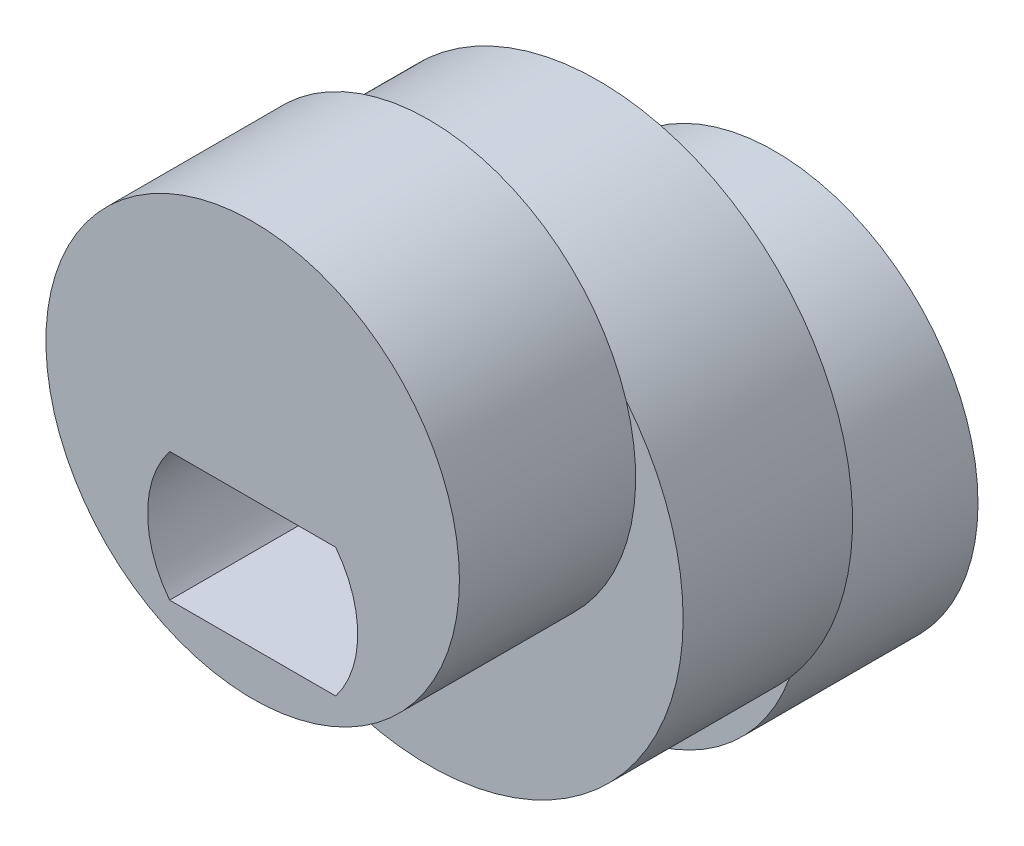
ISO-10303-21;
HEADER;
FILE_DESCRIPTION(('STEP AP214'),'2;1');
FILE_NAME('part.step','',(''),(''),'','','');
FILE_SCHEMA(('AUTOMOTIVE_DESIGN { 1 0 10303 214 1 1 1 1 }'));
ENDSEC;
DATA;
#1=APPLICATION_CONTEXT('core data for automotive mechanical design processes');
#2=APPLICATION_PROTOCOL_DEFINITION('international standard','automotive_design',2000,#1);
#3=PRODUCT_CONTEXT('',#1,'mechanical');
#4=PRODUCT('Part','Part','',(#3));
#5=PRODUCT_RELATED_PRODUCT_CATEGORY('part','',(#4));
#6=PRODUCT_DEFINITION_FORMATION('','',#4);
#7=PRODUCT_DEFINITION_CONTEXT('part definition',#1,'design');
#8=PRODUCT_DEFINITION('design','',#6,#7);
#9=PRODUCT_DEFINITION_SHAPE('','',#8);
#10=(LENGTH_UNIT() NAMED_UNIT(*) SI_UNIT(.MILLI.,.METRE.));
#11=(NAMED_UNIT(*) PLANE_ANGLE_UNIT() SI_UNIT($,.RADIAN.));
#12=(NAMED_UNIT(*) SI_UNIT($,.STERADIAN.) SOLID_ANGLE_UNIT());
#13=UNCERTAINTY_MEASURE_WITH_UNIT(LENGTH_MEASURE(1.E-05),#10,'distance_accuracy_value','');
#14=(GEOMETRIC_REPRESENTATION_CONTEXT(3) GLOBAL_UNCERTAINTY_ASSIGNED_CONTEXT((#13)) GLOBAL_UNIT_ASSIGNED_CONTEXT((#10,
#11,#12)) REPRESENTATION_CONTEXT('',''));
#15=CARTESIAN_POINT('',(0.,0.,0.));
#16=DIRECTION('',(0.,0.,1.));
#17=DIRECTION('',(1.,0.,0.));
#18=AXIS2_PLACEMENT_3D('',#15,#16,#17);
#19=CARTESIAN_POINT('',(0.,0.,2.5));
#20=DIRECTION('',(0.,0.,-1.));
#21=DIRECTION('',(-1.,0.,0.));
#22=AXIS2_PLACEMENT_3D('',#19,#20,#21);
#23=CYLINDRICAL_SURFACE('',#22,7.5);
#24=CARTESIAN_POINT('',(0.,0.,2.5));
#25=DIRECTION('',(0.,0.,1.));
#26=DIRECTION('',(1.,0.,0.));
#27=AXIS2_PLACEMENT_3D('',#24,#25,#26);
#28=CIRCLE('',#27,7.5);
#29=CARTESIAN_POINT('',(5.81816086390603,4.73275862068966,2.5));
#30=VERTEX_POINT('',#29);
#31=CARTESIAN_POINT('',(-5.81816086390603,4.73275862068966,2.5));
#32=VERTEX_POINT('',#31);
#33=EDGE_CURVE('E162',#30,#32,#28,.T.);
#34=ORIENTED_EDGE('',*,*,#33,.F.);
#35=EDGE_CURVE('E165',#32,#30,#28,.T.);
#36=ORIENTED_EDGE('',*,*,#35,.F.);
#37=EDGE_LOOP('',(#34,#36));
#38=FACE_BOUND('',#37,.T.);
#39=CARTESIAN_POINT('',(0.,0.,-2.5));
#40=DIRECTION('',(0.,0.,1.));
#41=DIRECTION('',(1.,0.,0.));
#42=AXIS2_PLACEMENT_3D('',#39,#40,#41);
#43=CIRCLE('',#42,7.5);
#44=CARTESIAN_POINT('',(-5.64205374941573,-4.94137931034483,-2.5));
#45=VERTEX_POINT('',#44);
#46=CARTESIAN_POINT('',(5.64205374941573,-4.94137931034483,-2.5));
#47=VERTEX_POINT('',#46);
#48=EDGE_CURVE('E48',#45,#47,#43,.T.);
#49=ORIENTED_EDGE('',*,*,#48,.T.);
#50=EDGE_CURVE('E159',#47,#45,#43,.T.);
#51=ORIENTED_EDGE('',*,*,#50,.T.);
#52=EDGE_LOOP('',(#49,#51));
#53=FACE_BOUND('',#52,.T.);
#54=ADVANCED_FACE('F45',(#38,#53),#23,.T.);
#55=CARTESIAN_POINT('',(0.,0.,2.5));
#56=DIRECTION('',(0.,0.,1.));
#57=DIRECTION('',(1.,0.,0.));
#58=AXIS2_PLACEMENT_3D('',#55,#56,#57);
#59=PLANE('',#58);
#60=CARTESIAN_POINT('',(0.,2.9,2.5));
#61=DIRECTION('',(0.,0.,1.));
#62=DIRECTION('',(1.,0.,0.));
#63=AXIS2_PLACEMENT_3D('',#60,#61,#62);
#64=CIRCLE('',#63,6.1);
#65=EDGE_CURVE('E54',#32,#30,#64,.T.);
#66=ORIENTED_EDGE('',*,*,#65,.F.);
#67=ORIENTED_EDGE('',*,*,#35,.T.);
#68=EDGE_LOOP('',(#66,#67));
#69=FACE_BOUND('',#68,.T.);
#70=ADVANCED_FACE('F189',(#69),#59,.T.);
#71=CARTESIAN_POINT('',(0.,0.,-2.5));
#72=DIRECTION('',(0.,0.,1.));
#73=DIRECTION('',(1.,0.,0.));
#74=AXIS2_PLACEMENT_3D('',#71,#72,#73);
#75=PLANE('',#74);
#76=CARTESIAN_POINT('',(0.,-2.9,-2.5));
#77=DIRECTION('',(0.,0.,-1.));
#78=DIRECTION('',(-1.,0.,0.));
#79=AXIS2_PLACEMENT_3D('',#76,#77,#78);
#80=CIRCLE('',#79,6.);
#81=EDGE_CURVE('E11',#45,#47,#80,.T.);
#82=ORIENTED_EDGE('',*,*,#81,.F.);
#83=ORIENTED_EDGE('',*,*,#50,.F.);
#84=EDGE_LOOP('',(#82,#83));
#85=FACE_BOUND('',#84,.T.);
#86=ADVANCED_FACE('F186',(#85),#75,.F.);
#87=CARTESIAN_POINT('',(0.,2.9,2.5));
#88=DIRECTION('',(0.,0.,1.));
#89=DIRECTION('',(1.,0.,0.));
#90=AXIS2_PLACEMENT_3D('',#87,#88,#89);
#91=PLANE('',#90);
#92=EDGE_CURVE('E151',#30,#32,#64,.T.);
#93=ORIENTED_EDGE('',*,*,#92,.F.);
#94=ORIENTED_EDGE('',*,*,#33,.T.);
#95=EDGE_LOOP('',(#93,#94));
#96=FACE_BOUND('',#95,.T.);
#97=ADVANCED_FACE('F188',(#96),#91,.F.);
#98=CARTESIAN_POINT('',(0.,2.9,7.7));
#99=DIRECTION('',(0.,0.,-1.));
#100=DIRECTION('',(-1.,0.,0.));
#101=AXIS2_PLACEMENT_3D('',#98,#99,#100);
#102=CYLINDRICAL_SURFACE('',#101,6.1);
#103=CARTESIAN_POINT('',(0.,2.9,7.7));
#104=DIRECTION('',(0.,0.,1.));
#105=DIRECTION('',(1.,0.,0.));
#106=AXIS2_PLACEMENT_3D('',#103,#104,#105);
#107=CIRCLE('',#106,6.1);
#108=CARTESIAN_POINT('',(6.1,2.9,7.7));
#109=VERTEX_POINT('',#108);
#110=EDGE_CURVE('E155',#109,#109,#107,.T.);
#111=ORIENTED_EDGE('',*,*,#110,.F.);
#112=EDGE_LOOP('',(#111));
#113=FACE_BOUND('',#112,.T.);
#114=ORIENTED_EDGE('',*,*,#92,.T.);
#115=ORIENTED_EDGE('',*,*,#65,.T.);
#116=EDGE_LOOP('',(#114,#115));
#117=FACE_BOUND('',#116,.T.);
#118=ADVANCED_FACE('F195',(#113,#117),#102,.T.);
#119=CARTESIAN_POINT('',(0.,2.9,7.7));
#120=DIRECTION('',(0.,0.,1.));
#121=DIRECTION('',(1.,0.,0.));
#122=AXIS2_PLACEMENT_3D('',#119,#120,#121);
#123=PLANE('',#122);
#124=CARTESIAN_POINT('',(0.,0.,7.7));
#125=DIRECTION('',(0.,0.,1.));
#126=DIRECTION('',(1.,0.,0.));
#127=AXIS2_PLACEMENT_3D('',#124,#125,#126);
#128=CIRCLE('',#127,3.1);
#129=CARTESIAN_POINT('',(-2.44948974278318,1.9,7.7));
#130=VERTEX_POINT('',#129);
#131=CARTESIAN_POINT('',(-2.44948974278318,-1.9,7.7));
#132=VERTEX_POINT('',#131);
#133=EDGE_CURVE('E63',#130,#132,#128,.T.);
#134=ORIENTED_EDGE('',*,*,#133,.F.);
#135=DIRECTION('',(-1.,0.,0.));
#136=VECTOR('',#135,1.);
#137=CARTESIAN_POINT('',(-2.44948974278318,1.9,7.7));
#138=LINE('',#137,#136);
#139=CARTESIAN_POINT('',(2.44948974278318,1.9,7.7));
#140=VERTEX_POINT('',#139);
#141=EDGE_CURVE('E121',#140,#130,#138,.T.);
#142=ORIENTED_EDGE('',*,*,#141,.F.);
#143=CARTESIAN_POINT('',(0.,0.,7.7));
#144=DIRECTION('',(0.,0.,1.));
#145=DIRECTION('',(1.,0.,0.));
#146=AXIS2_PLACEMENT_3D('',#143,#144,#145);
#147=CIRCLE('',#146,3.1);
#148=CARTESIAN_POINT('',(2.44948974278318,-1.9,7.7));
#149=VERTEX_POINT('',#148);
#150=EDGE_CURVE('E103',#149,#140,#147,.T.);
#151=ORIENTED_EDGE('',*,*,#150,.F.);
#152=DIRECTION('',(1.,0.,0.));
#153=VECTOR('',#152,1.);
#154=CARTESIAN_POINT('',(-2.44948974278318,-1.9,7.7));
#155=LINE('',#154,#153);
#156=EDGE_CURVE('E113',#132,#149,#155,.T.);
#157=ORIENTED_EDGE('',*,*,#156,.F.);
#158=EDGE_LOOP('',(#134,#142,#151,#157));
#159=FACE_BOUND('',#158,.T.);
#160=ORIENTED_EDGE('',*,*,#110,.T.);
#161=EDGE_LOOP('',(#160));
#162=FACE_BOUND('',#161,.T.);
#163=ADVANCED_FACE('F118',(#159,#162),#123,.T.);
#164=CARTESIAN_POINT('',(0.,-2.9,-7.7));
#165=DIRECTION('',(0.,0.,1.));
#166=DIRECTION('',(1.,0.,0.));
#167=AXIS2_PLACEMENT_3D('',#164,#165,#166);
#168=CYLINDRICAL_SURFACE('',#167,6.);
#169=CARTESIAN_POINT('',(0.,-2.9,-7.7));
#170=DIRECTION('',(0.,0.,-1.));
#171=DIRECTION('',(-1.,0.,0.));
#172=AXIS2_PLACEMENT_3D('',#169,#170,#171);
#173=CIRCLE('',#172,6.);
#174=CARTESIAN_POINT('',(-6.,-2.9,-7.7));
#175=VERTEX_POINT('',#174);
#176=EDGE_CURVE('E148',#175,#175,#173,.T.);
#177=ORIENTED_EDGE('',*,*,#176,.F.);
#178=EDGE_LOOP('',(#177));
#179=FACE_BOUND('',#178,.T.);
#180=EDGE_CURVE('E56',#47,#45,#80,.T.);
#181=ORIENTED_EDGE('',*,*,#180,.T.);
#182=ORIENTED_EDGE('',*,*,#81,.T.);
#183=EDGE_LOOP('',(#181,#182));
#184=FACE_BOUND('',#183,.T.);
#185=ADVANCED_FACE('F185',(#179,#184),#168,.T.);
#186=CARTESIAN_POINT('',(0.,-2.9,-7.7));
#187=DIRECTION('',(0.,0.,-1.));
#188=DIRECTION('',(-1.,0.,0.));
#189=AXIS2_PLACEMENT_3D('',#186,#187,#188);
#190=PLANE('',#189);
#191=CARTESIAN_POINT('',(0.,0.,-7.7));
#192=DIRECTION('',(0.,0.,1.));
#193=DIRECTION('',(1.,0.,0.));
#194=AXIS2_PLACEMENT_3D('',#191,#192,#193);
#195=CIRCLE('',#194,3.1);
#196=CARTESIAN_POINT('',(-2.44948974278318,1.9,-7.7));
#197=VERTEX_POINT('',#196);
#198=CARTESIAN_POINT('',(-2.44948974278318,-1.9,-7.7));
#199=VERTEX_POINT('',#198);
#200=EDGE_CURVE('E125',#197,#199,#195,.T.);
#201=ORIENTED_EDGE('',*,*,#200,.T.);
#202=DIRECTION('',(1.,0.,0.));
#203=VECTOR('',#202,1.);
#204=CARTESIAN_POINT('',(-2.44948974278318,-1.9,-7.7));
#205=LINE('',#204,#203);
#206=CARTESIAN_POINT('',(2.44948974278318,-1.9,-7.7));
#207=VERTEX_POINT('',#206);
#208=EDGE_CURVE('E132',#199,#207,#205,.T.);
#209=ORIENTED_EDGE('',*,*,#208,.T.);
#210=CARTESIAN_POINT('',(0.,0.,-7.7));
#211=DIRECTION('',(0.,0.,1.));
#212=DIRECTION('',(1.,0.,0.));
#213=AXIS2_PLACEMENT_3D('',#210,#211,#212);
#214=CIRCLE('',#213,3.1);
#215=CARTESIAN_POINT('',(2.44948974278318,1.9,-7.7));
#216=VERTEX_POINT('',#215);
#217=EDGE_CURVE('E71',#207,#216,#214,.T.);
#218=ORIENTED_EDGE('',*,*,#217,.T.);
#219=DIRECTION('',(-1.,0.,0.));
#220=VECTOR('',#219,1.);
#221=CARTESIAN_POINT('',(-2.44948974278318,1.9,-7.7));
#222=LINE('',#221,#220);
#223=EDGE_CURVE('E137',#216,#197,#222,.T.);
#224=ORIENTED_EDGE('',*,*,#223,.T.);
#225=EDGE_LOOP('',(#201,#209,#218,#224));
#226=FACE_BOUND('',#225,.T.);
#227=ORIENTED_EDGE('',*,*,#176,.T.);
#228=EDGE_LOOP('',(#227));
#229=FACE_BOUND('',#228,.T.);
#230=ADVANCED_FACE('F241',(#226,#229),#190,.T.);
#231=CARTESIAN_POINT('',(0.,-2.9,-2.5));
#232=DIRECTION('',(0.,0.,-1.));
#233=DIRECTION('',(-1.,0.,0.));
#234=AXIS2_PLACEMENT_3D('',#231,#232,#233);
#235=PLANE('',#234);
#236=ORIENTED_EDGE('',*,*,#48,.F.);
#237=ORIENTED_EDGE('',*,*,#180,.F.);
#238=EDGE_LOOP('',(#236,#237));
#239=FACE_BOUND('',#238,.T.);
#240=ADVANCED_FACE('F183',(#239),#235,.F.);
#241=CARTESIAN_POINT('',(0.,0.,-7.7));
#242=DIRECTION('',(0.,0.,1.));
#243=DIRECTION('',(1.,0.,0.));
#244=AXIS2_PLACEMENT_3D('',#241,#242,#243);
#245=CYLINDRICAL_SURFACE('',#244,3.1);
#246=DIRECTION('',(0.,0.,1.));
#247=VECTOR('',#246,1.);
#248=CARTESIAN_POINT('',(-2.44948974278318,-1.9,-7.7));
#249=LINE('',#248,#247);
#250=EDGE_CURVE('E110',#199,#132,#249,.T.);
#251=ORIENTED_EDGE('',*,*,#250,.F.);
#252=ORIENTED_EDGE('',*,*,#200,.F.);
#253=DIRECTION('',(0.,0.,1.));
#254=VECTOR('',#253,1.);
#255=CARTESIAN_POINT('',(-2.44948974278318,1.9,-7.7));
#256=LINE('',#255,#254);
#257=EDGE_CURVE('E141',#197,#130,#256,.T.);
#258=ORIENTED_EDGE('',*,*,#257,.T.);
#259=ORIENTED_EDGE('',*,*,#133,.T.);
#260=EDGE_LOOP('',(#251,#252,#258,#259));
#261=FACE_BOUND('',#260,.T.);
#262=ADVANCED_FACE('F258',(#261),#245,.F.);
#263=CARTESIAN_POINT('',(-2.44948974278318,1.9,-7.7));
#264=DIRECTION('',(0.,1.,0.));
#265=DIRECTION('',(-1.,0.,0.));
#266=AXIS2_PLACEMENT_3D('',#263,#264,#265);
#267=PLANE('',#266);
#268=ORIENTED_EDGE('',*,*,#257,.F.);
#269=ORIENTED_EDGE('',*,*,#223,.F.);
#270=DIRECTION('',(0.,0.,1.));
#271=VECTOR('',#270,1.);
#272=CARTESIAN_POINT('',(2.44948974278318,1.9,-7.7));
#273=LINE('',#272,#271);
#274=EDGE_CURVE('E109',#216,#140,#273,.T.);
#275=ORIENTED_EDGE('',*,*,#274,.T.);
#276=ORIENTED_EDGE('',*,*,#141,.T.);
#277=EDGE_LOOP('',(#268,#269,#275,#276));
#278=FACE_BOUND('',#277,.T.);
#279=ADVANCED_FACE('F266',(#278),#267,.F.);
#280=CARTESIAN_POINT('',(0.,0.,-7.7));
#281=DIRECTION('',(0.,0.,1.));
#282=DIRECTION('',(1.,0.,0.));
#283=AXIS2_PLACEMENT_3D('',#280,#281,#282);
#284=CYLINDRICAL_SURFACE('',#283,3.1);
#285=ORIENTED_EDGE('',*,*,#274,.F.);
#286=ORIENTED_EDGE('',*,*,#217,.F.);
#287=DIRECTION('',(0.,0.,1.));
#288=VECTOR('',#287,1.);
#289=CARTESIAN_POINT('',(2.44948974278318,-1.9,-7.7));
#290=LINE('',#289,#288);
#291=EDGE_CURVE('E99',#207,#149,#290,.T.);
#292=ORIENTED_EDGE('',*,*,#291,.T.);
#293=ORIENTED_EDGE('',*,*,#150,.T.);
#294=EDGE_LOOP('',(#285,#286,#292,#293));
#295=FACE_BOUND('',#294,.T.);
#296=ADVANCED_FACE('F101',(#295),#284,.F.);
#297=CARTESIAN_POINT('',(-2.44948974278318,-1.9,-7.7));
#298=DIRECTION('',(0.,-1.,0.));
#299=DIRECTION('',(0.,0.,-1.));
#300=AXIS2_PLACEMENT_3D('',#297,#298,#299);
#301=PLANE('',#300);
#302=ORIENTED_EDGE('',*,*,#291,.F.);
#303=ORIENTED_EDGE('',*,*,#208,.F.);
#304=ORIENTED_EDGE('',*,*,#250,.T.);
#305=ORIENTED_EDGE('',*,*,#156,.T.);
#306=EDGE_LOOP('',(#302,#303,#304,#305));
#307=FACE_BOUND('',#306,.T.);
#308=ADVANCED_FACE('F114',(#307),#301,.F.);
#309=CLOSED_SHELL('',(#54,#70,#86,#97,#118,#163,#185,#230,#240,#262,#279,#296,#308));
#310=MANIFOLD_SOLID_BREP('B2',#309);
#311=ADVANCED_BREP_SHAPE_REPRESENTATION('',(#18,#310),#14);
#312=SHAPE_DEFINITION_REPRESENTATION(#9,#311);
ENDSEC;
END-ISO-10303-21;
